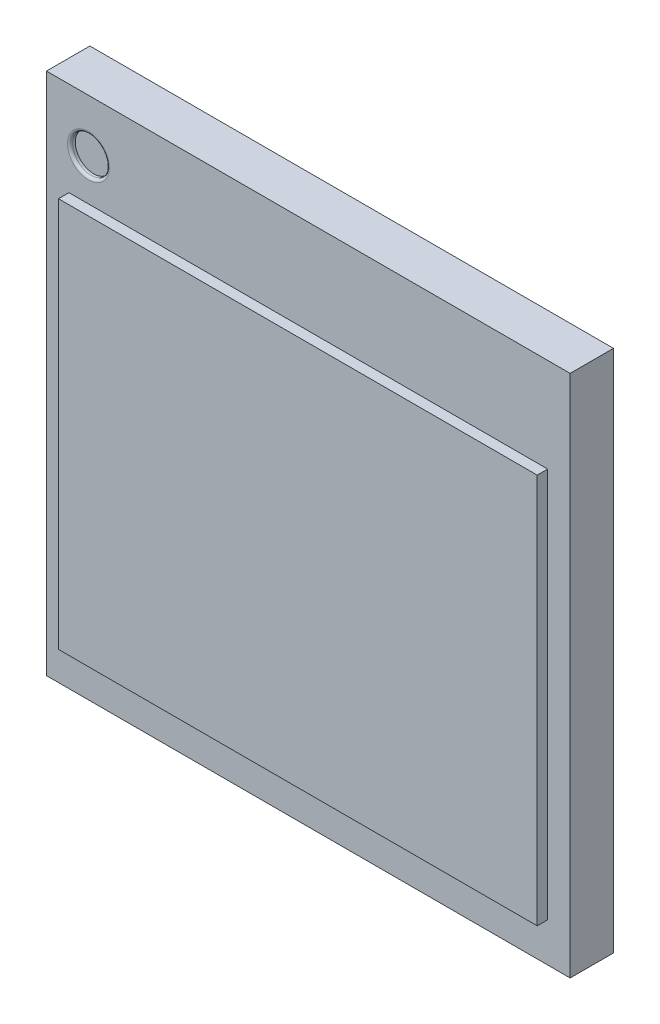
ISO-10303-21;
HEADER;
FILE_DESCRIPTION(('STEP AP214'),'2;1');
FILE_NAME('part.step','',(''),(''),'','','');
FILE_SCHEMA(('AUTOMOTIVE_DESIGN { 1 0 10303 214 1 1 1 1 }'));
ENDSEC;
DATA;
#1=APPLICATION_CONTEXT('core data for automotive mechanical design processes');
#2=APPLICATION_PROTOCOL_DEFINITION('international standard','automotive_design',2000,#1);
#3=PRODUCT_CONTEXT('',#1,'mechanical');
#4=PRODUCT('Part','Part','',(#3));
#5=PRODUCT_RELATED_PRODUCT_CATEGORY('part','',(#4));
#6=PRODUCT_DEFINITION_FORMATION('','',#4);
#7=PRODUCT_DEFINITION_CONTEXT('part definition',#1,'design');
#8=PRODUCT_DEFINITION('design','',#6,#7);
#9=PRODUCT_DEFINITION_SHAPE('','',#8);
#10=(LENGTH_UNIT() NAMED_UNIT(*) SI_UNIT(.MILLI.,.METRE.));
#11=(NAMED_UNIT(*) PLANE_ANGLE_UNIT() SI_UNIT($,.RADIAN.));
#12=(NAMED_UNIT(*) SI_UNIT($,.STERADIAN.) SOLID_ANGLE_UNIT());
#13=UNCERTAINTY_MEASURE_WITH_UNIT(LENGTH_MEASURE(1.E-05),#10,'distance_accuracy_value','');
#14=(GEOMETRIC_REPRESENTATION_CONTEXT(3) GLOBAL_UNCERTAINTY_ASSIGNED_CONTEXT((#13)) GLOBAL_UNIT_ASSIGNED_CONTEXT((#10,
#11,#12)) REPRESENTATION_CONTEXT('',''));
#15=CARTESIAN_POINT('',(0.,0.,0.));
#16=DIRECTION('',(0.,0.,1.));
#17=DIRECTION('',(1.,0.,0.));
#18=AXIS2_PLACEMENT_3D('',#15,#16,#17);
#19=CARTESIAN_POINT('',(0.,0.,0.624));
#20=DIRECTION('',(0.,0.,1.));
#21=DIRECTION('',(1.,0.,0.));
#22=AXIS2_PLACEMENT_3D('',#19,#20,#21);
#23=PLANE('',#22);
#24=CARTESIAN_POINT('',(-2.1,2.,0.624));
#25=DIRECTION('',(0.,0.,1.));
#26=DIRECTION('',(1.,0.,0.));
#27=AXIS2_PLACEMENT_3D('',#24,#25,#26);
#28=CIRCLE('',#27,0.2);
#29=CARTESIAN_POINT('',(-1.9,2.,0.624));
#30=VERTEX_POINT('',#29);
#31=EDGE_CURVE('E11',#30,#30,#28,.F.);
#32=ORIENTED_EDGE('',*,*,#31,.T.);
#33=EDGE_LOOP('',(#32));
#34=FACE_BOUND('',#33,.T.);
#35=DIRECTION('',(0.,-1.,0.));
#36=VECTOR('',#35,1.);
#37=CARTESIAN_POINT('',(-2.5,2.5,0.624));
#38=LINE('',#37,#36);
#39=CARTESIAN_POINT('',(-2.5,2.5,0.624));
#40=VERTEX_POINT('',#39);
#41=CARTESIAN_POINT('',(-2.5,-2.5,0.624));
#42=VERTEX_POINT('',#41);
#43=EDGE_CURVE('E145',#40,#42,#38,.T.);
#44=ORIENTED_EDGE('',*,*,#43,.T.);
#45=DIRECTION('',(1.,0.,0.));
#46=VECTOR('',#45,1.);
#47=CARTESIAN_POINT('',(-2.5,-2.5,0.624));
#48=LINE('',#47,#46);
#49=CARTESIAN_POINT('',(2.5,-2.5,0.624));
#50=VERTEX_POINT('',#49);
#51=EDGE_CURVE('E90',#42,#50,#48,.T.);
#52=ORIENTED_EDGE('',*,*,#51,.T.);
#53=DIRECTION('',(0.,1.,0.));
#54=VECTOR('',#53,1.);
#55=CARTESIAN_POINT('',(2.5,2.5,0.624));
#56=LINE('',#55,#54);
#57=CARTESIAN_POINT('',(2.5,2.5,0.624));
#58=VERTEX_POINT('',#57);
#59=EDGE_CURVE('E148',#50,#58,#56,.T.);
#60=ORIENTED_EDGE('',*,*,#59,.T.);
#61=DIRECTION('',(-1.,0.,0.));
#62=VECTOR('',#61,1.);
#63=CARTESIAN_POINT('',(-2.5,2.5,0.624));
#64=LINE('',#63,#62);
#65=EDGE_CURVE('E61',#58,#40,#64,.T.);
#66=ORIENTED_EDGE('',*,*,#65,.T.);
#67=EDGE_LOOP('',(#44,#52,#60,#66));
#68=FACE_BOUND('',#67,.T.);
#69=DIRECTION('',(-1.,0.,0.));
#70=VECTOR('',#69,1.);
#71=CARTESIAN_POINT('',(-2.28579882244162,1.60135243721626,0.624));
#72=LINE('',#71,#70);
#73=CARTESIAN_POINT('',(2.28579882244162,1.60135243721626,0.624));
#74=VERTEX_POINT('',#73);
#75=CARTESIAN_POINT('',(-2.28579882244162,1.60135243721626,0.624));
#76=VERTEX_POINT('',#75);
#77=EDGE_CURVE('E303',#74,#76,#72,.T.);
#78=ORIENTED_EDGE('',*,*,#77,.F.);
#79=DIRECTION('',(0.,1.,0.));
#80=VECTOR('',#79,1.);
#81=CARTESIAN_POINT('',(2.28579882244162,1.60135243721626,0.624));
#82=LINE('',#81,#80);
#83=CARTESIAN_POINT('',(2.28579882244162,-2.125692027521,0.624));
#84=VERTEX_POINT('',#83);
#85=EDGE_CURVE('E135',#84,#74,#82,.T.);
#86=ORIENTED_EDGE('',*,*,#85,.F.);
#87=DIRECTION('',(1.,0.,0.));
#88=VECTOR('',#87,1.);
#89=CARTESIAN_POINT('',(-2.28579882244162,-2.125692027521,0.624));
#90=LINE('',#89,#88);
#91=CARTESIAN_POINT('',(-2.28579882244162,-2.125692027521,0.624));
#92=VERTEX_POINT('',#91);
#93=EDGE_CURVE('E131',#92,#84,#90,.T.);
#94=ORIENTED_EDGE('',*,*,#93,.F.);
#95=DIRECTION('',(0.,-1.,0.));
#96=VECTOR('',#95,1.);
#97=CARTESIAN_POINT('',(-2.28579882244162,1.60135243721626,0.624));
#98=LINE('',#97,#96);
#99=EDGE_CURVE('E305',#76,#92,#98,.T.);
#100=ORIENTED_EDGE('',*,*,#99,.F.);
#101=EDGE_LOOP('',(#78,#86,#94,#100));
#102=FACE_BOUND('',#101,.T.);
#103=ADVANCED_FACE('F37',(#34,#68,#102),#23,.T.);
#104=CARTESIAN_POINT('',(0.,0.,0.21));
#105=DIRECTION('',(0.,0.,1.));
#106=DIRECTION('',(1.,0.,0.));
#107=AXIS2_PLACEMENT_3D('',#104,#105,#106);
#108=PLANE('',#107);
#109=DIRECTION('',(0.,-1.,0.));
#110=VECTOR('',#109,1.);
#111=CARTESIAN_POINT('',(-2.5,2.5,0.21));
#112=LINE('',#111,#110);
#113=CARTESIAN_POINT('',(-2.5,2.5,0.21));
#114=VERTEX_POINT('',#113);
#115=CARTESIAN_POINT('',(-2.5,-2.5,0.21));
#116=VERTEX_POINT('',#115);
#117=EDGE_CURVE('E140',#114,#116,#112,.T.);
#118=ORIENTED_EDGE('',*,*,#117,.F.);
#119=DIRECTION('',(-1.,0.,0.));
#120=VECTOR('',#119,1.);
#121=CARTESIAN_POINT('',(-2.5,2.5,0.21));
#122=LINE('',#121,#120);
#123=CARTESIAN_POINT('',(2.5,2.5,0.21));
#124=VERTEX_POINT('',#123);
#125=EDGE_CURVE('E82',#124,#114,#122,.T.);
#126=ORIENTED_EDGE('',*,*,#125,.F.);
#127=DIRECTION('',(0.,1.,0.));
#128=VECTOR('',#127,1.);
#129=CARTESIAN_POINT('',(2.5,2.5,0.21));
#130=LINE('',#129,#128);
#131=CARTESIAN_POINT('',(2.5,-2.5,0.21));
#132=VERTEX_POINT('',#131);
#133=EDGE_CURVE('E156',#132,#124,#130,.T.);
#134=ORIENTED_EDGE('',*,*,#133,.F.);
#135=DIRECTION('',(1.,0.,0.));
#136=VECTOR('',#135,1.);
#137=CARTESIAN_POINT('',(-2.5,-2.5,0.21));
#138=LINE('',#137,#136);
#139=EDGE_CURVE('E154',#116,#132,#138,.T.);
#140=ORIENTED_EDGE('',*,*,#139,.F.);
#141=EDGE_LOOP('',(#118,#126,#134,#140));
#142=FACE_BOUND('',#141,.T.);
#143=CARTESIAN_POINT('',(-1.96,1.9,0.21));
#144=DIRECTION('',(0.,0.,1.));
#145=DIRECTION('',(1.,0.,0.));
#146=AXIS2_PLACEMENT_3D('',#143,#144,#145);
#147=CIRCLE('',#146,0.148492424049175);
#148=CARTESIAN_POINT('',(-1.81150757595082,1.9,0.21));
#149=VERTEX_POINT('',#148);
#150=EDGE_CURVE('E167',#149,#149,#147,.F.);
#151=ORIENTED_EDGE('',*,*,#150,.F.);
#152=EDGE_LOOP('',(#151));
#153=FACE_BOUND('',#152,.T.);
#154=CARTESIAN_POINT('',(-1.16,1.9,0.21));
#155=DIRECTION('',(0.,0.,1.));
#156=DIRECTION('',(1.,0.,0.));
#157=AXIS2_PLACEMENT_3D('',#154,#155,#156);
#158=CIRCLE('',#157,0.148492424049175);
#159=CARTESIAN_POINT('',(-1.01150757595082,1.9,0.21));
#160=VERTEX_POINT('',#159);
#161=EDGE_CURVE('E170',#160,#160,#158,.F.);
#162=ORIENTED_EDGE('',*,*,#161,.F.);
#163=EDGE_LOOP('',(#162));
#164=FACE_BOUND('',#163,.T.);
#165=CARTESIAN_POINT('',(-0.36,1.9,0.21));
#166=DIRECTION('',(0.,0.,1.));
#167=DIRECTION('',(1.,0.,0.));
#168=AXIS2_PLACEMENT_3D('',#165,#166,#167);
#169=CIRCLE('',#168,0.148492424049175);
#170=CARTESIAN_POINT('',(-0.211507575950825,1.9,0.21));
#171=VERTEX_POINT('',#170);
#172=EDGE_CURVE('E173',#171,#171,#169,.F.);
#173=ORIENTED_EDGE('',*,*,#172,.F.);
#174=EDGE_LOOP('',(#173));
#175=FACE_BOUND('',#174,.T.);
#176=CARTESIAN_POINT('',(0.44,1.9,0.21));
#177=DIRECTION('',(0.,0.,1.));
#178=DIRECTION('',(1.,0.,0.));
#179=AXIS2_PLACEMENT_3D('',#176,#177,#178);
#180=CIRCLE('',#179,0.148492424049175);
#181=CARTESIAN_POINT('',(0.588492424049175,1.9,0.21));
#182=VERTEX_POINT('',#181);
#183=EDGE_CURVE('E176',#182,#182,#180,.F.);
#184=ORIENTED_EDGE('',*,*,#183,.F.);
#185=EDGE_LOOP('',(#184));
#186=FACE_BOUND('',#185,.T.);
#187=CARTESIAN_POINT('',(1.24,1.9,0.21));
#188=DIRECTION('',(0.,0.,1.));
#189=DIRECTION('',(1.,0.,0.));
#190=AXIS2_PLACEMENT_3D('',#187,#188,#189);
#191=CIRCLE('',#190,0.148492424049175);
#192=CARTESIAN_POINT('',(1.38849242404918,1.9,0.21));
#193=VERTEX_POINT('',#192);
#194=EDGE_CURVE('E179',#193,#193,#191,.F.);
#195=ORIENTED_EDGE('',*,*,#194,.F.);
#196=EDGE_LOOP('',(#195));
#197=FACE_BOUND('',#196,.T.);
#198=CARTESIAN_POINT('',(2.04,1.9,0.21));
#199=DIRECTION('',(0.,0.,1.));
#200=DIRECTION('',(1.,0.,0.));
#201=AXIS2_PLACEMENT_3D('',#198,#199,#200);
#202=CIRCLE('',#201,0.148492424049175);
#203=CARTESIAN_POINT('',(2.18849242404918,1.9,0.21));
#204=VERTEX_POINT('',#203);
#205=EDGE_CURVE('E182',#204,#204,#202,.F.);
#206=ORIENTED_EDGE('',*,*,#205,.F.);
#207=EDGE_LOOP('',(#206));
#208=FACE_BOUND('',#207,.T.);
#209=CARTESIAN_POINT('',(-1.96,1.15,0.21));
#210=DIRECTION('',(0.,0.,1.));
#211=DIRECTION('',(1.,0.,0.));
#212=AXIS2_PLACEMENT_3D('',#209,#210,#211);
#213=CIRCLE('',#212,0.148492424049175);
#214=CARTESIAN_POINT('',(-1.81150757595082,1.15,0.21));
#215=VERTEX_POINT('',#214);
#216=EDGE_CURVE('E185',#215,#215,#213,.F.);
#217=ORIENTED_EDGE('',*,*,#216,.F.);
#218=EDGE_LOOP('',(#217));
#219=FACE_BOUND('',#218,.T.);
#220=CARTESIAN_POINT('',(-1.16,1.15,0.21));
#221=DIRECTION('',(0.,0.,1.));
#222=DIRECTION('',(1.,0.,0.));
#223=AXIS2_PLACEMENT_3D('',#220,#221,#222);
#224=CIRCLE('',#223,0.148492424049175);
#225=CARTESIAN_POINT('',(-1.01150757595082,1.15,0.21));
#226=VERTEX_POINT('',#225);
#227=EDGE_CURVE('E188',#226,#226,#224,.F.);
#228=ORIENTED_EDGE('',*,*,#227,.F.);
#229=EDGE_LOOP('',(#228));
#230=FACE_BOUND('',#229,.T.);
#231=CARTESIAN_POINT('',(-0.36,1.15,0.21));
#232=DIRECTION('',(0.,0.,1.));
#233=DIRECTION('',(1.,0.,0.));
#234=AXIS2_PLACEMENT_3D('',#231,#232,#233);
#235=CIRCLE('',#234,0.148492424049175);
#236=CARTESIAN_POINT('',(-0.211507575950825,1.15,0.21));
#237=VERTEX_POINT('',#236);
#238=EDGE_CURVE('E191',#237,#237,#235,.F.);
#239=ORIENTED_EDGE('',*,*,#238,.F.);
#240=EDGE_LOOP('',(#239));
#241=FACE_BOUND('',#240,.T.);
#242=CARTESIAN_POINT('',(0.44,1.15,0.21));
#243=DIRECTION('',(0.,0.,1.));
#244=DIRECTION('',(1.,0.,0.));
#245=AXIS2_PLACEMENT_3D('',#242,#243,#244);
#246=CIRCLE('',#245,0.148492424049175);
#247=CARTESIAN_POINT('',(0.588492424049175,1.15,0.21));
#248=VERTEX_POINT('',#247);
#249=EDGE_CURVE('E194',#248,#248,#246,.F.);
#250=ORIENTED_EDGE('',*,*,#249,.F.);
#251=EDGE_LOOP('',(#250));
#252=FACE_BOUND('',#251,.T.);
#253=CARTESIAN_POINT('',(1.24,1.15,0.21));
#254=DIRECTION('',(0.,0.,1.));
#255=DIRECTION('',(1.,0.,0.));
#256=AXIS2_PLACEMENT_3D('',#253,#254,#255);
#257=CIRCLE('',#256,0.148492424049175);
#258=CARTESIAN_POINT('',(1.38849242404918,1.15,0.21));
#259=VERTEX_POINT('',#258);
#260=EDGE_CURVE('E197',#259,#259,#257,.F.);
#261=ORIENTED_EDGE('',*,*,#260,.F.);
#262=EDGE_LOOP('',(#261));
#263=FACE_BOUND('',#262,.T.);
#264=CARTESIAN_POINT('',(2.04,1.15,0.21));
#265=DIRECTION('',(0.,0.,1.));
#266=DIRECTION('',(1.,0.,0.));
#267=AXIS2_PLACEMENT_3D('',#264,#265,#266);
#268=CIRCLE('',#267,0.148492424049175);
#269=CARTESIAN_POINT('',(2.18849242404918,1.15,0.21));
#270=VERTEX_POINT('',#269);
#271=EDGE_CURVE('E200',#270,#270,#268,.F.);
#272=ORIENTED_EDGE('',*,*,#271,.F.);
#273=EDGE_LOOP('',(#272));
#274=FACE_BOUND('',#273,.T.);
#275=CARTESIAN_POINT('',(-1.96,0.4,0.21));
#276=DIRECTION('',(0.,0.,1.));
#277=DIRECTION('',(1.,0.,0.));
#278=AXIS2_PLACEMENT_3D('',#275,#276,#277);
#279=CIRCLE('',#278,0.148492424049175);
#280=CARTESIAN_POINT('',(-1.81150757595082,0.4,0.21));
#281=VERTEX_POINT('',#280);
#282=EDGE_CURVE('E203',#281,#281,#279,.F.);
#283=ORIENTED_EDGE('',*,*,#282,.F.);
#284=EDGE_LOOP('',(#283));
#285=FACE_BOUND('',#284,.T.);
#286=CARTESIAN_POINT('',(2.04,0.399999999999999,0.21));
#287=DIRECTION('',(0.,0.,1.));
#288=DIRECTION('',(1.,0.,0.));
#289=AXIS2_PLACEMENT_3D('',#286,#287,#288);
#290=CIRCLE('',#289,0.148492424049175);
#291=CARTESIAN_POINT('',(2.18849242404918,0.399999999999999,0.21));
#292=VERTEX_POINT('',#291);
#293=EDGE_CURVE('E206',#292,#292,#290,.F.);
#294=ORIENTED_EDGE('',*,*,#293,.F.);
#295=EDGE_LOOP('',(#294));
#296=FACE_BOUND('',#295,.T.);
#297=CARTESIAN_POINT('',(-1.96,-0.35,0.21));
#298=DIRECTION('',(0.,0.,1.));
#299=DIRECTION('',(1.,0.,0.));
#300=AXIS2_PLACEMENT_3D('',#297,#298,#299);
#301=CIRCLE('',#300,0.148492424049175);
#302=CARTESIAN_POINT('',(-1.81150757595082,-0.35,0.21));
#303=VERTEX_POINT('',#302);
#304=EDGE_CURVE('E209',#303,#303,#301,.F.);
#305=ORIENTED_EDGE('',*,*,#304,.F.);
#306=EDGE_LOOP('',(#305));
#307=FACE_BOUND('',#306,.T.);
#308=CARTESIAN_POINT('',(2.04,-0.350000000000001,0.21));
#309=DIRECTION('',(0.,0.,1.));
#310=DIRECTION('',(1.,0.,0.));
#311=AXIS2_PLACEMENT_3D('',#308,#309,#310);
#312=CIRCLE('',#311,0.148492424049175);
#313=CARTESIAN_POINT('',(2.18849242404918,-0.350000000000001,0.21));
#314=VERTEX_POINT('',#313);
#315=EDGE_CURVE('E212',#314,#314,#312,.F.);
#316=ORIENTED_EDGE('',*,*,#315,.F.);
#317=EDGE_LOOP('',(#316));
#318=FACE_BOUND('',#317,.T.);
#319=CARTESIAN_POINT('',(-1.96,-1.1,0.21));
#320=DIRECTION('',(0.,0.,1.));
#321=DIRECTION('',(1.,0.,0.));
#322=AXIS2_PLACEMENT_3D('',#319,#320,#321);
#323=CIRCLE('',#322,0.148492424049175);
#324=CARTESIAN_POINT('',(-1.81150757595082,-1.1,0.21));
#325=VERTEX_POINT('',#324);
#326=EDGE_CURVE('E215',#325,#325,#323,.F.);
#327=ORIENTED_EDGE('',*,*,#326,.F.);
#328=EDGE_LOOP('',(#327));
#329=FACE_BOUND('',#328,.T.);
#330=CARTESIAN_POINT('',(-1.16,-1.1,0.21));
#331=DIRECTION('',(0.,0.,1.));
#332=DIRECTION('',(1.,0.,0.));
#333=AXIS2_PLACEMENT_3D('',#330,#331,#332);
#334=CIRCLE('',#333,0.148492424049175);
#335=CARTESIAN_POINT('',(-1.01150757595082,-1.1,0.21));
#336=VERTEX_POINT('',#335);
#337=EDGE_CURVE('E218',#336,#336,#334,.F.);
#338=ORIENTED_EDGE('',*,*,#337,.F.);
#339=EDGE_LOOP('',(#338));
#340=FACE_BOUND('',#339,.T.);
#341=CARTESIAN_POINT('',(-0.359999999999999,-1.1,0.21));
#342=DIRECTION('',(0.,0.,1.));
#343=DIRECTION('',(1.,0.,0.));
#344=AXIS2_PLACEMENT_3D('',#341,#342,#343);
#345=CIRCLE('',#344,0.148492424049175);
#346=CARTESIAN_POINT('',(-0.211507575950824,-1.1,0.21));
#347=VERTEX_POINT('',#346);
#348=EDGE_CURVE('E221',#347,#347,#345,.F.);
#349=ORIENTED_EDGE('',*,*,#348,.F.);
#350=EDGE_LOOP('',(#349));
#351=FACE_BOUND('',#350,.T.);
#352=CARTESIAN_POINT('',(0.440000000000001,-1.1,0.21));
#353=DIRECTION('',(0.,0.,1.));
#354=DIRECTION('',(1.,0.,0.));
#355=AXIS2_PLACEMENT_3D('',#352,#353,#354);
#356=CIRCLE('',#355,0.148492424049175);
#357=CARTESIAN_POINT('',(0.588492424049176,-1.1,0.21));
#358=VERTEX_POINT('',#357);
#359=EDGE_CURVE('E224',#358,#358,#356,.F.);
#360=ORIENTED_EDGE('',*,*,#359,.F.);
#361=EDGE_LOOP('',(#360));
#362=FACE_BOUND('',#361,.T.);
#363=CARTESIAN_POINT('',(1.24,-1.1,0.21));
#364=DIRECTION('',(0.,0.,1.));
#365=DIRECTION('',(1.,0.,0.));
#366=AXIS2_PLACEMENT_3D('',#363,#364,#365);
#367=CIRCLE('',#366,0.148492424049175);
#368=CARTESIAN_POINT('',(1.38849242404918,-1.1,0.21));
#369=VERTEX_POINT('',#368);
#370=EDGE_CURVE('E227',#369,#369,#367,.F.);
#371=ORIENTED_EDGE('',*,*,#370,.F.);
#372=EDGE_LOOP('',(#371));
#373=FACE_BOUND('',#372,.T.);
#374=CARTESIAN_POINT('',(2.04,-1.1,0.21));
#375=DIRECTION('',(0.,0.,1.));
#376=DIRECTION('',(1.,0.,0.));
#377=AXIS2_PLACEMENT_3D('',#374,#375,#376);
#378=CIRCLE('',#377,0.148492424049175);
#379=CARTESIAN_POINT('',(2.18849242404918,-1.1,0.21));
#380=VERTEX_POINT('',#379);
#381=EDGE_CURVE('E230',#380,#380,#378,.F.);
#382=ORIENTED_EDGE('',*,*,#381,.F.);
#383=EDGE_LOOP('',(#382));
#384=FACE_BOUND('',#383,.T.);
#385=CARTESIAN_POINT('',(-1.96,-1.85,0.21));
#386=DIRECTION('',(0.,0.,1.));
#387=DIRECTION('',(1.,0.,0.));
#388=AXIS2_PLACEMENT_3D('',#385,#386,#387);
#389=CIRCLE('',#388,0.148492424049175);
#390=CARTESIAN_POINT('',(-1.81150757595082,-1.85,0.21));
#391=VERTEX_POINT('',#390);
#392=EDGE_CURVE('E233',#391,#391,#389,.F.);
#393=ORIENTED_EDGE('',*,*,#392,.F.);
#394=EDGE_LOOP('',(#393));
#395=FACE_BOUND('',#394,.T.);
#396=CARTESIAN_POINT('',(-1.16,-1.85,0.21));
#397=DIRECTION('',(0.,0.,1.));
#398=DIRECTION('',(1.,0.,0.));
#399=AXIS2_PLACEMENT_3D('',#396,#397,#398);
#400=CIRCLE('',#399,0.148492424049175);
#401=CARTESIAN_POINT('',(-1.01150757595082,-1.85,0.21));
#402=VERTEX_POINT('',#401);
#403=EDGE_CURVE('E236',#402,#402,#400,.F.);
#404=ORIENTED_EDGE('',*,*,#403,.F.);
#405=EDGE_LOOP('',(#404));
#406=FACE_BOUND('',#405,.T.);
#407=CARTESIAN_POINT('',(-0.359999999999999,-1.85,0.21));
#408=DIRECTION('',(0.,0.,1.));
#409=DIRECTION('',(1.,0.,0.));
#410=AXIS2_PLACEMENT_3D('',#407,#408,#409);
#411=CIRCLE('',#410,0.148492424049175);
#412=CARTESIAN_POINT('',(-0.211507575950824,-1.85,0.21));
#413=VERTEX_POINT('',#412);
#414=EDGE_CURVE('E239',#413,#413,#411,.F.);
#415=ORIENTED_EDGE('',*,*,#414,.F.);
#416=EDGE_LOOP('',(#415));
#417=FACE_BOUND('',#416,.T.);
#418=CARTESIAN_POINT('',(0.440000000000001,-1.85,0.21));
#419=DIRECTION('',(0.,0.,1.));
#420=DIRECTION('',(1.,0.,0.));
#421=AXIS2_PLACEMENT_3D('',#418,#419,#420);
#422=CIRCLE('',#421,0.148492424049175);
#423=CARTESIAN_POINT('',(0.588492424049176,-1.85,0.21));
#424=VERTEX_POINT('',#423);
#425=EDGE_CURVE('E242',#424,#424,#422,.F.);
#426=ORIENTED_EDGE('',*,*,#425,.F.);
#427=EDGE_LOOP('',(#426));
#428=FACE_BOUND('',#427,.T.);
#429=CARTESIAN_POINT('',(1.24,-1.85,0.21));
#430=DIRECTION('',(0.,0.,1.));
#431=DIRECTION('',(1.,0.,0.));
#432=AXIS2_PLACEMENT_3D('',#429,#430,#431);
#433=CIRCLE('',#432,0.148492424049175);
#434=CARTESIAN_POINT('',(1.38849242404918,-1.85,0.21));
#435=VERTEX_POINT('',#434);
#436=EDGE_CURVE('E245',#435,#435,#433,.F.);
#437=ORIENTED_EDGE('',*,*,#436,.F.);
#438=EDGE_LOOP('',(#437));
#439=FACE_BOUND('',#438,.T.);
#440=CARTESIAN_POINT('',(2.04,-1.85,0.21));
#441=DIRECTION('',(0.,0.,1.));
#442=DIRECTION('',(1.,0.,0.));
#443=AXIS2_PLACEMENT_3D('',#440,#441,#442);
#444=CIRCLE('',#443,0.148492424049175);
#445=CARTESIAN_POINT('',(2.18849242404918,-1.85,0.21));
#446=VERTEX_POINT('',#445);
#447=EDGE_CURVE('E248',#446,#446,#444,.F.);
#448=ORIENTED_EDGE('',*,*,#447,.F.);
#449=EDGE_LOOP('',(#448));
#450=FACE_BOUND('',#449,.T.);
#451=ADVANCED_FACE('F268',(#142,#153,#164,#175,#186,#197,#208,#219,#230,#241,#252,#263,#274,
#285,#296,#307,#318,#329,#340,#351,#362,#373,#384,#395,#406,#417,#428,#439,#450),#108,.F.);
#452=CARTESIAN_POINT('',(-2.5,2.5,0.624));
#453=DIRECTION('',(1.,0.,0.));
#454=DIRECTION('',(0.,1.,0.));
#455=AXIS2_PLACEMENT_3D('',#452,#453,#454);
#456=PLANE('',#455);
#457=ORIENTED_EDGE('',*,*,#117,.T.);
#458=DIRECTION('',(0.,0.,-1.));
#459=VECTOR('',#458,1.);
#460=CARTESIAN_POINT('',(-2.5,-2.5,0.624));
#461=LINE('',#460,#459);
#462=EDGE_CURVE('E165',#42,#116,#461,.T.);
#463=ORIENTED_EDGE('',*,*,#462,.F.);
#464=ORIENTED_EDGE('',*,*,#43,.F.);
#465=DIRECTION('',(0.,0.,-1.));
#466=VECTOR('',#465,1.);
#467=CARTESIAN_POINT('',(-2.5,2.5,0.624));
#468=LINE('',#467,#466);
#469=EDGE_CURVE('E151',#40,#114,#468,.T.);
#470=ORIENTED_EDGE('',*,*,#469,.T.);
#471=EDGE_LOOP('',(#457,#463,#464,#470));
#472=FACE_BOUND('',#471,.T.);
#473=ADVANCED_FACE('F274',(#472),#456,.F.);
#474=CARTESIAN_POINT('',(-2.5,-2.5,0.624));
#475=DIRECTION('',(0.,1.,0.));
#476=DIRECTION('',(0.,0.,1.));
#477=AXIS2_PLACEMENT_3D('',#474,#475,#476);
#478=PLANE('',#477);
#479=ORIENTED_EDGE('',*,*,#139,.T.);
#480=DIRECTION('',(0.,0.,-1.));
#481=VECTOR('',#480,1.);
#482=CARTESIAN_POINT('',(2.5,-2.5,0.624));
#483=LINE('',#482,#481);
#484=EDGE_CURVE('E162',#50,#132,#483,.T.);
#485=ORIENTED_EDGE('',*,*,#484,.F.);
#486=ORIENTED_EDGE('',*,*,#51,.F.);
#487=ORIENTED_EDGE('',*,*,#462,.T.);
#488=EDGE_LOOP('',(#479,#485,#486,#487));
#489=FACE_BOUND('',#488,.T.);
#490=ADVANCED_FACE('F287',(#489),#478,.F.);
#491=CARTESIAN_POINT('',(2.5,2.5,0.624));
#492=DIRECTION('',(-1.,0.,0.));
#493=DIRECTION('',(0.,0.,1.));
#494=AXIS2_PLACEMENT_3D('',#491,#492,#493);
#495=PLANE('',#494);
#496=ORIENTED_EDGE('',*,*,#133,.T.);
#497=DIRECTION('',(0.,0.,-1.));
#498=VECTOR('',#497,1.);
#499=CARTESIAN_POINT('',(2.5,2.5,0.624));
#500=LINE('',#499,#498);
#501=EDGE_CURVE('E160',#58,#124,#500,.T.);
#502=ORIENTED_EDGE('',*,*,#501,.F.);
#503=ORIENTED_EDGE('',*,*,#59,.F.);
#504=ORIENTED_EDGE('',*,*,#484,.T.);
#505=EDGE_LOOP('',(#496,#502,#503,#504));
#506=FACE_BOUND('',#505,.T.);
#507=ADVANCED_FACE('F284',(#506),#495,.F.);
#508=CARTESIAN_POINT('',(-2.5,2.5,0.624));
#509=DIRECTION('',(0.,-1.,0.));
#510=DIRECTION('',(1.,0.,0.));
#511=AXIS2_PLACEMENT_3D('',#508,#509,#510);
#512=PLANE('',#511);
#513=ORIENTED_EDGE('',*,*,#125,.T.);
#514=ORIENTED_EDGE('',*,*,#469,.F.);
#515=ORIENTED_EDGE('',*,*,#65,.F.);
#516=ORIENTED_EDGE('',*,*,#501,.T.);
#517=EDGE_LOOP('',(#513,#514,#515,#516));
#518=FACE_BOUND('',#517,.T.);
#519=ADVANCED_FACE('F281',(#518),#512,.F.);
#520=CARTESIAN_POINT('',(-1.96,1.9,0.1575));
#521=DIRECTION('',(0.,0.,1.));
#522=DIRECTION('',(-1.,0.,0.));
#523=AXIS2_PLACEMENT_3D('',#520,#521,#522);
#524=SPHERICAL_SURFACE('',#523,0.1575);
#525=ORIENTED_EDGE('',*,*,#150,.T.);
#526=EDGE_LOOP('',(#525));
#527=FACE_BOUND('',#526,.T.);
#528=ADVANCED_FACE('F278',(#527),#524,.T.);
#529=CARTESIAN_POINT('',(-1.16,1.9,0.1575));
#530=DIRECTION('',(0.,0.,1.));
#531=DIRECTION('',(-1.,0.,0.));
#532=AXIS2_PLACEMENT_3D('',#529,#530,#531);
#533=SPHERICAL_SURFACE('',#532,0.1575);
#534=ORIENTED_EDGE('',*,*,#161,.T.);
#535=EDGE_LOOP('',(#534));
#536=FACE_BOUND('',#535,.T.);
#537=ADVANCED_FACE('F432',(#536),#533,.T.);
#538=CARTESIAN_POINT('',(-0.36,1.9,0.1575));
#539=DIRECTION('',(0.,0.,1.));
#540=DIRECTION('',(-1.,0.,0.));
#541=AXIS2_PLACEMENT_3D('',#538,#539,#540);
#542=SPHERICAL_SURFACE('',#541,0.1575);
#543=ORIENTED_EDGE('',*,*,#172,.T.);
#544=EDGE_LOOP('',(#543));
#545=FACE_BOUND('',#544,.T.);
#546=ADVANCED_FACE('F429',(#545),#542,.T.);
#547=CARTESIAN_POINT('',(0.44,1.9,0.1575));
#548=DIRECTION('',(0.,0.,1.));
#549=DIRECTION('',(-1.,0.,0.));
#550=AXIS2_PLACEMENT_3D('',#547,#548,#549);
#551=SPHERICAL_SURFACE('',#550,0.1575);
#552=ORIENTED_EDGE('',*,*,#183,.T.);
#553=EDGE_LOOP('',(#552));
#554=FACE_BOUND('',#553,.T.);
#555=ADVANCED_FACE('F425',(#554),#551,.T.);
#556=CARTESIAN_POINT('',(1.24,1.9,0.1575));
#557=DIRECTION('',(0.,0.,1.));
#558=DIRECTION('',(-1.,0.,0.));
#559=AXIS2_PLACEMENT_3D('',#556,#557,#558);
#560=SPHERICAL_SURFACE('',#559,0.1575);
#561=ORIENTED_EDGE('',*,*,#194,.T.);
#562=EDGE_LOOP('',(#561));
#563=FACE_BOUND('',#562,.T.);
#564=ADVANCED_FACE('F421',(#563),#560,.T.);
#565=CARTESIAN_POINT('',(2.04,1.9,0.1575));
#566=DIRECTION('',(0.,0.,1.));
#567=DIRECTION('',(-1.,0.,0.));
#568=AXIS2_PLACEMENT_3D('',#565,#566,#567);
#569=SPHERICAL_SURFACE('',#568,0.1575);
#570=ORIENTED_EDGE('',*,*,#205,.T.);
#571=EDGE_LOOP('',(#570));
#572=FACE_BOUND('',#571,.T.);
#573=ADVANCED_FACE('F417',(#572),#569,.T.);
#574=CARTESIAN_POINT('',(-1.96,1.15,0.1575));
#575=DIRECTION('',(0.,0.,1.));
#576=DIRECTION('',(-1.,0.,0.));
#577=AXIS2_PLACEMENT_3D('',#574,#575,#576);
#578=SPHERICAL_SURFACE('',#577,0.1575);
#579=ORIENTED_EDGE('',*,*,#216,.T.);
#580=EDGE_LOOP('',(#579));
#581=FACE_BOUND('',#580,.T.);
#582=ADVANCED_FACE('F413',(#581),#578,.T.);
#583=CARTESIAN_POINT('',(-1.16,1.15,0.1575));
#584=DIRECTION('',(0.,0.,1.));
#585=DIRECTION('',(-1.,0.,0.));
#586=AXIS2_PLACEMENT_3D('',#583,#584,#585);
#587=SPHERICAL_SURFACE('',#586,0.1575);
#588=ORIENTED_EDGE('',*,*,#227,.T.);
#589=EDGE_LOOP('',(#588));
#590=FACE_BOUND('',#589,.T.);
#591=ADVANCED_FACE('F409',(#590),#587,.T.);
#592=CARTESIAN_POINT('',(-0.36,1.15,0.1575));
#593=DIRECTION('',(0.,0.,1.));
#594=DIRECTION('',(-1.,0.,0.));
#595=AXIS2_PLACEMENT_3D('',#592,#593,#594);
#596=SPHERICAL_SURFACE('',#595,0.1575);
#597=ORIENTED_EDGE('',*,*,#238,.T.);
#598=EDGE_LOOP('',(#597));
#599=FACE_BOUND('',#598,.T.);
#600=ADVANCED_FACE('F405',(#599),#596,.T.);
#601=CARTESIAN_POINT('',(0.44,1.15,0.1575));
#602=DIRECTION('',(0.,0.,1.));
#603=DIRECTION('',(-1.,0.,0.));
#604=AXIS2_PLACEMENT_3D('',#601,#602,#603);
#605=SPHERICAL_SURFACE('',#604,0.1575);
#606=ORIENTED_EDGE('',*,*,#249,.T.);
#607=EDGE_LOOP('',(#606));
#608=FACE_BOUND('',#607,.T.);
#609=ADVANCED_FACE('F401',(#608),#605,.T.);
#610=CARTESIAN_POINT('',(1.24,1.15,0.1575));
#611=DIRECTION('',(0.,0.,1.));
#612=DIRECTION('',(-1.,0.,0.));
#613=AXIS2_PLACEMENT_3D('',#610,#611,#612);
#614=SPHERICAL_SURFACE('',#613,0.1575);
#615=ORIENTED_EDGE('',*,*,#260,.T.);
#616=EDGE_LOOP('',(#615));
#617=FACE_BOUND('',#616,.T.);
#618=ADVANCED_FACE('F397',(#617),#614,.T.);
#619=CARTESIAN_POINT('',(2.04,1.15,0.1575));
#620=DIRECTION('',(0.,0.,1.));
#621=DIRECTION('',(-1.,0.,0.));
#622=AXIS2_PLACEMENT_3D('',#619,#620,#621);
#623=SPHERICAL_SURFACE('',#622,0.1575);
#624=ORIENTED_EDGE('',*,*,#271,.T.);
#625=EDGE_LOOP('',(#624));
#626=FACE_BOUND('',#625,.T.);
#627=ADVANCED_FACE('F393',(#626),#623,.T.);
#628=CARTESIAN_POINT('',(-1.96,0.4,0.1575));
#629=DIRECTION('',(0.,0.,1.));
#630=DIRECTION('',(-1.,0.,0.));
#631=AXIS2_PLACEMENT_3D('',#628,#629,#630);
#632=SPHERICAL_SURFACE('',#631,0.1575);
#633=ORIENTED_EDGE('',*,*,#282,.T.);
#634=EDGE_LOOP('',(#633));
#635=FACE_BOUND('',#634,.T.);
#636=ADVANCED_FACE('F389',(#635),#632,.T.);
#637=CARTESIAN_POINT('',(2.04,0.399999999999999,0.1575));
#638=DIRECTION('',(0.,0.,1.));
#639=DIRECTION('',(-1.,0.,0.));
#640=AXIS2_PLACEMENT_3D('',#637,#638,#639);
#641=SPHERICAL_SURFACE('',#640,0.1575);
#642=ORIENTED_EDGE('',*,*,#293,.T.);
#643=EDGE_LOOP('',(#642));
#644=FACE_BOUND('',#643,.T.);
#645=ADVANCED_FACE('F385',(#644),#641,.T.);
#646=CARTESIAN_POINT('',(-1.96,-0.35,0.1575));
#647=DIRECTION('',(0.,0.,1.));
#648=DIRECTION('',(-1.,0.,0.));
#649=AXIS2_PLACEMENT_3D('',#646,#647,#648);
#650=SPHERICAL_SURFACE('',#649,0.1575);
#651=ORIENTED_EDGE('',*,*,#304,.T.);
#652=EDGE_LOOP('',(#651));
#653=FACE_BOUND('',#652,.T.);
#654=ADVANCED_FACE('F381',(#653),#650,.T.);
#655=CARTESIAN_POINT('',(2.04,-0.350000000000001,0.1575));
#656=DIRECTION('',(0.,0.,1.));
#657=DIRECTION('',(-1.,0.,0.));
#658=AXIS2_PLACEMENT_3D('',#655,#656,#657);
#659=SPHERICAL_SURFACE('',#658,0.1575);
#660=ORIENTED_EDGE('',*,*,#315,.T.);
#661=EDGE_LOOP('',(#660));
#662=FACE_BOUND('',#661,.T.);
#663=ADVANCED_FACE('F377',(#662),#659,.T.);
#664=CARTESIAN_POINT('',(-1.96,-1.1,0.1575));
#665=DIRECTION('',(0.,0.,1.));
#666=DIRECTION('',(-1.,0.,0.));
#667=AXIS2_PLACEMENT_3D('',#664,#665,#666);
#668=SPHERICAL_SURFACE('',#667,0.1575);
#669=ORIENTED_EDGE('',*,*,#326,.T.);
#670=EDGE_LOOP('',(#669));
#671=FACE_BOUND('',#670,.T.);
#672=ADVANCED_FACE('F373',(#671),#668,.T.);
#673=CARTESIAN_POINT('',(-1.16,-1.1,0.1575));
#674=DIRECTION('',(0.,0.,1.));
#675=DIRECTION('',(-1.,0.,0.));
#676=AXIS2_PLACEMENT_3D('',#673,#674,#675);
#677=SPHERICAL_SURFACE('',#676,0.1575);
#678=ORIENTED_EDGE('',*,*,#337,.T.);
#679=EDGE_LOOP('',(#678));
#680=FACE_BOUND('',#679,.T.);
#681=ADVANCED_FACE('F369',(#680),#677,.T.);
#682=CARTESIAN_POINT('',(-0.359999999999999,-1.1,0.1575));
#683=DIRECTION('',(0.,0.,1.));
#684=DIRECTION('',(-1.,0.,0.));
#685=AXIS2_PLACEMENT_3D('',#682,#683,#684);
#686=SPHERICAL_SURFACE('',#685,0.1575);
#687=ORIENTED_EDGE('',*,*,#348,.T.);
#688=EDGE_LOOP('',(#687));
#689=FACE_BOUND('',#688,.T.);
#690=ADVANCED_FACE('F365',(#689),#686,.T.);
#691=CARTESIAN_POINT('',(0.440000000000001,-1.1,0.1575));
#692=DIRECTION('',(0.,0.,1.));
#693=DIRECTION('',(-1.,0.,0.));
#694=AXIS2_PLACEMENT_3D('',#691,#692,#693);
#695=SPHERICAL_SURFACE('',#694,0.1575);
#696=ORIENTED_EDGE('',*,*,#359,.T.);
#697=EDGE_LOOP('',(#696));
#698=FACE_BOUND('',#697,.T.);
#699=ADVANCED_FACE('F361',(#698),#695,.T.);
#700=CARTESIAN_POINT('',(1.24,-1.1,0.1575));
#701=DIRECTION('',(0.,0.,1.));
#702=DIRECTION('',(-1.,0.,0.));
#703=AXIS2_PLACEMENT_3D('',#700,#701,#702);
#704=SPHERICAL_SURFACE('',#703,0.1575);
#705=ORIENTED_EDGE('',*,*,#370,.T.);
#706=EDGE_LOOP('',(#705));
#707=FACE_BOUND('',#706,.T.);
#708=ADVANCED_FACE('F357',(#707),#704,.T.);
#709=CARTESIAN_POINT('',(2.04,-1.1,0.1575));
#710=DIRECTION('',(0.,0.,1.));
#711=DIRECTION('',(-1.,0.,0.));
#712=AXIS2_PLACEMENT_3D('',#709,#710,#711);
#713=SPHERICAL_SURFACE('',#712,0.1575);
#714=ORIENTED_EDGE('',*,*,#381,.T.);
#715=EDGE_LOOP('',(#714));
#716=FACE_BOUND('',#715,.T.);
#717=ADVANCED_FACE('F353',(#716),#713,.T.);
#718=CARTESIAN_POINT('',(-1.96,-1.85,0.1575));
#719=DIRECTION('',(0.,0.,1.));
#720=DIRECTION('',(-1.,0.,0.));
#721=AXIS2_PLACEMENT_3D('',#718,#719,#720);
#722=SPHERICAL_SURFACE('',#721,0.1575);
#723=ORIENTED_EDGE('',*,*,#392,.T.);
#724=EDGE_LOOP('',(#723));
#725=FACE_BOUND('',#724,.T.);
#726=ADVANCED_FACE('F349',(#725),#722,.T.);
#727=CARTESIAN_POINT('',(-1.16,-1.85,0.1575));
#728=DIRECTION('',(0.,0.,1.));
#729=DIRECTION('',(-1.,0.,0.));
#730=AXIS2_PLACEMENT_3D('',#727,#728,#729);
#731=SPHERICAL_SURFACE('',#730,0.1575);
#732=ORIENTED_EDGE('',*,*,#403,.T.);
#733=EDGE_LOOP('',(#732));
#734=FACE_BOUND('',#733,.T.);
#735=ADVANCED_FACE('F345',(#734),#731,.T.);
#736=CARTESIAN_POINT('',(-0.359999999999999,-1.85,0.1575));
#737=DIRECTION('',(0.,0.,1.));
#738=DIRECTION('',(-1.,0.,0.));
#739=AXIS2_PLACEMENT_3D('',#736,#737,#738);
#740=SPHERICAL_SURFACE('',#739,0.1575);
#741=ORIENTED_EDGE('',*,*,#414,.T.);
#742=EDGE_LOOP('',(#741));
#743=FACE_BOUND('',#742,.T.);
#744=ADVANCED_FACE('F341',(#743),#740,.T.);
#745=CARTESIAN_POINT('',(0.440000000000001,-1.85,0.1575));
#746=DIRECTION('',(0.,0.,1.));
#747=DIRECTION('',(-1.,0.,0.));
#748=AXIS2_PLACEMENT_3D('',#745,#746,#747);
#749=SPHERICAL_SURFACE('',#748,0.1575);
#750=ORIENTED_EDGE('',*,*,#425,.T.);
#751=EDGE_LOOP('',(#750));
#752=FACE_BOUND('',#751,.T.);
#753=ADVANCED_FACE('F337',(#752),#749,.T.);
#754=CARTESIAN_POINT('',(1.24,-1.85,0.1575));
#755=DIRECTION('',(0.,0.,1.));
#756=DIRECTION('',(-1.,0.,0.));
#757=AXIS2_PLACEMENT_3D('',#754,#755,#756);
#758=SPHERICAL_SURFACE('',#757,0.1575);
#759=ORIENTED_EDGE('',*,*,#436,.T.);
#760=EDGE_LOOP('',(#759));
#761=FACE_BOUND('',#760,.T.);
#762=ADVANCED_FACE('F333',(#761),#758,.T.);
#763=CARTESIAN_POINT('',(2.04,-1.85,0.1575));
#764=DIRECTION('',(0.,0.,1.));
#765=DIRECTION('',(-1.,0.,0.));
#766=AXIS2_PLACEMENT_3D('',#763,#764,#765);
#767=SPHERICAL_SURFACE('',#766,0.1575);
#768=ORIENTED_EDGE('',*,*,#447,.T.);
#769=EDGE_LOOP('',(#768));
#770=FACE_BOUND('',#769,.T.);
#771=ADVANCED_FACE('F330',(#770),#767,.T.);
#772=CARTESIAN_POINT('',(-2.1,2.,0.574));
#773=DIRECTION('',(0.,0.,1.));
#774=DIRECTION('',(1.,0.,0.));
#775=AXIS2_PLACEMENT_3D('',#772,#773,#774);
#776=CYLINDRICAL_SURFACE('',#775,0.175);
#777=CARTESIAN_POINT('',(-2.1,2.,0.599));
#778=DIRECTION('',(0.,0.,1.));
#779=DIRECTION('',(1.,0.,0.));
#780=AXIS2_PLACEMENT_3D('',#777,#778,#779);
#781=CIRCLE('',#780,0.175);
#782=CARTESIAN_POINT('',(-1.925,2.,0.599));
#783=VERTEX_POINT('',#782);
#784=EDGE_CURVE('E45',#783,#783,#781,.T.);
#785=ORIENTED_EDGE('',*,*,#784,.T.);
#786=EDGE_LOOP('',(#785));
#787=FACE_BOUND('',#786,.T.);
#788=CARTESIAN_POINT('',(-2.1,2.,0.574));
#789=DIRECTION('',(0.,0.,1.));
#790=DIRECTION('',(1.,0.,0.));
#791=AXIS2_PLACEMENT_3D('',#788,#789,#790);
#792=CIRCLE('',#791,0.175);
#793=CARTESIAN_POINT('',(-1.925,2.,0.574));
#794=VERTEX_POINT('',#793);
#795=EDGE_CURVE('E137',#794,#794,#792,.T.);
#796=ORIENTED_EDGE('',*,*,#795,.F.);
#797=EDGE_LOOP('',(#796));
#798=FACE_BOUND('',#797,.T.);
#799=ADVANCED_FACE('F253',(#787,#798),#776,.F.);
#800=CARTESIAN_POINT('',(-2.1,2.,0.574));
#801=DIRECTION('',(0.,0.,1.));
#802=DIRECTION('',(1.,0.,0.));
#803=AXIS2_PLACEMENT_3D('',#800,#801,#802);
#804=PLANE('',#803);
#805=ORIENTED_EDGE('',*,*,#795,.T.);
#806=EDGE_LOOP('',(#805));
#807=FACE_BOUND('',#806,.T.);
#808=ADVANCED_FACE('F257',(#807),#804,.T.);
#809=CARTESIAN_POINT('',(-2.1,2.,0.599));
#810=DIRECTION('',(0.,0.,1.));
#811=DIRECTION('',(1.,0.,0.));
#812=AXIS2_PLACEMENT_3D('',#809,#810,#811);
#813=TOROIDAL_SURFACE('',#812,0.2,0.025);
#814=ORIENTED_EDGE('',*,*,#31,.F.);
#815=EDGE_LOOP('',(#814));
#816=FACE_BOUND('',#815,.T.);
#817=ORIENTED_EDGE('',*,*,#784,.F.);
#818=EDGE_LOOP('',(#817));
#819=FACE_BOUND('',#818,.T.);
#820=ADVANCED_FACE('F39',(#816,#819),#813,.T.);
#821=CARTESIAN_POINT('',(2.28579882244162,1.60135243721626,0.724));
#822=DIRECTION('',(-1.,0.,0.));
#823=DIRECTION('',(0.,0.,1.));
#824=AXIS2_PLACEMENT_3D('',#821,#822,#823);
#825=PLANE('',#824);
#826=ORIENTED_EDGE('',*,*,#85,.T.);
#827=DIRECTION('',(0.,0.,-1.));
#828=VECTOR('',#827,1.);
#829=CARTESIAN_POINT('',(2.28579882244162,1.60135243721626,0.724));
#830=LINE('',#829,#828);
#831=CARTESIAN_POINT('',(2.28579882244162,1.60135243721626,0.724));
#832=VERTEX_POINT('',#831);
#833=EDGE_CURVE('E116',#832,#74,#830,.T.);
#834=ORIENTED_EDGE('',*,*,#833,.F.);
#835=DIRECTION('',(0.,1.,0.));
#836=VECTOR('',#835,1.);
#837=CARTESIAN_POINT('',(2.28579882244162,1.60135243721626,0.724));
#838=LINE('',#837,#836);
#839=CARTESIAN_POINT('',(2.28579882244162,-2.125692027521,0.724));
#840=VERTEX_POINT('',#839);
#841=EDGE_CURVE('E123',#840,#832,#838,.T.);
#842=ORIENTED_EDGE('',*,*,#841,.F.);
#843=DIRECTION('',(0.,0.,-1.));
#844=VECTOR('',#843,1.);
#845=CARTESIAN_POINT('',(2.28579882244162,-2.125692027521,0.724));
#846=LINE('',#845,#844);
#847=EDGE_CURVE('E312',#840,#84,#846,.T.);
#848=ORIENTED_EDGE('',*,*,#847,.T.);
#849=EDGE_LOOP('',(#826,#834,#842,#848));
#850=FACE_BOUND('',#849,.T.);
#851=ADVANCED_FACE('F133',(#850),#825,.F.);
#852=CARTESIAN_POINT('',(-2.28579882244162,1.60135243721626,0.724));
#853=DIRECTION('',(0.,-1.,0.));
#854=DIRECTION('',(0.,0.,-1.));
#855=AXIS2_PLACEMENT_3D('',#852,#853,#854);
#856=PLANE('',#855);
#857=ORIENTED_EDGE('',*,*,#77,.T.);
#858=DIRECTION('',(0.,0.,-1.));
#859=VECTOR('',#858,1.);
#860=CARTESIAN_POINT('',(-2.28579882244162,1.60135243721626,0.724));
#861=LINE('',#860,#859);
#862=CARTESIAN_POINT('',(-2.28579882244162,1.60135243721626,0.724));
#863=VERTEX_POINT('',#862);
#864=EDGE_CURVE('E119',#863,#76,#861,.T.);
#865=ORIENTED_EDGE('',*,*,#864,.F.);
#866=DIRECTION('',(-1.,0.,0.));
#867=VECTOR('',#866,1.);
#868=CARTESIAN_POINT('',(-2.28579882244162,1.60135243721626,0.724));
#869=LINE('',#868,#867);
#870=EDGE_CURVE('E112',#832,#863,#869,.T.);
#871=ORIENTED_EDGE('',*,*,#870,.F.);
#872=ORIENTED_EDGE('',*,*,#833,.T.);
#873=EDGE_LOOP('',(#857,#865,#871,#872));
#874=FACE_BOUND('',#873,.T.);
#875=ADVANCED_FACE('F114',(#874),#856,.F.);
#876=CARTESIAN_POINT('',(-2.28579882244162,1.60135243721626,0.724));
#877=DIRECTION('',(1.,0.,0.));
#878=DIRECTION('',(0.,0.,-1.));
#879=AXIS2_PLACEMENT_3D('',#876,#877,#878);
#880=PLANE('',#879);
#881=ORIENTED_EDGE('',*,*,#99,.T.);
#882=DIRECTION('',(0.,0.,-1.));
#883=VECTOR('',#882,1.);
#884=CARTESIAN_POINT('',(-2.28579882244162,-2.125692027521,0.724));
#885=LINE('',#884,#883);
#886=CARTESIAN_POINT('',(-2.28579882244162,-2.125692027521,0.724));
#887=VERTEX_POINT('',#886);
#888=EDGE_CURVE('E52',#887,#92,#885,.T.);
#889=ORIENTED_EDGE('',*,*,#888,.F.);
#890=DIRECTION('',(0.,-1.,0.));
#891=VECTOR('',#890,1.);
#892=CARTESIAN_POINT('',(-2.28579882244162,1.60135243721626,0.724));
#893=LINE('',#892,#891);
#894=EDGE_CURVE('E122',#863,#887,#893,.T.);
#895=ORIENTED_EDGE('',*,*,#894,.F.);
#896=ORIENTED_EDGE('',*,*,#864,.T.);
#897=EDGE_LOOP('',(#881,#889,#895,#896));
#898=FACE_BOUND('',#897,.T.);
#899=ADVANCED_FACE('F315',(#898),#880,.F.);
#900=CARTESIAN_POINT('',(-2.28579882244162,-2.125692027521,0.724));
#901=DIRECTION('',(0.,1.,0.));
#902=DIRECTION('',(0.,0.,1.));
#903=AXIS2_PLACEMENT_3D('',#900,#901,#902);
#904=PLANE('',#903);
#905=ORIENTED_EDGE('',*,*,#93,.T.);
#906=ORIENTED_EDGE('',*,*,#847,.F.);
#907=DIRECTION('',(1.,0.,0.));
#908=VECTOR('',#907,1.);
#909=CARTESIAN_POINT('',(-2.28579882244162,-2.125692027521,0.724));
#910=LINE('',#909,#908);
#911=EDGE_CURVE('E127',#887,#840,#910,.T.);
#912=ORIENTED_EDGE('',*,*,#911,.F.);
#913=ORIENTED_EDGE('',*,*,#888,.T.);
#914=EDGE_LOOP('',(#905,#906,#912,#913));
#915=FACE_BOUND('',#914,.T.);
#916=ADVANCED_FACE('F316',(#915),#904,.F.);
#917=CARTESIAN_POINT('',(0.,0.,0.724));
#918=DIRECTION('',(0.,0.,1.));
#919=DIRECTION('',(1.,0.,0.));
#920=AXIS2_PLACEMENT_3D('',#917,#918,#919);
#921=PLANE('',#920);
#922=ORIENTED_EDGE('',*,*,#841,.T.);
#923=ORIENTED_EDGE('',*,*,#870,.T.);
#924=ORIENTED_EDGE('',*,*,#894,.T.);
#925=ORIENTED_EDGE('',*,*,#911,.T.);
#926=EDGE_LOOP('',(#922,#923,#924,#925));
#927=FACE_BOUND('',#926,.T.);
#928=ADVANCED_FACE('F126',(#927),#921,.T.);
#929=CLOSED_SHELL('',(#103,#451,#473,#490,#507,#519,#528,#537,#546,#555,#564,#573,#582,#591,
#600,#609,#618,#627,#636,#645,#654,#663,#672,#681,#690,#699,#708,#717,#726,#735,#744,#753,#762,
#771,#799,#808,#820,#851,#875,#899,#916,#928));
#930=MANIFOLD_SOLID_BREP('B2',#929);
#931=ADVANCED_BREP_SHAPE_REPRESENTATION('',(#18,#930),#14);
#932=SHAPE_DEFINITION_REPRESENTATION(#9,#931);
ENDSEC;
END-ISO-10303-21;
